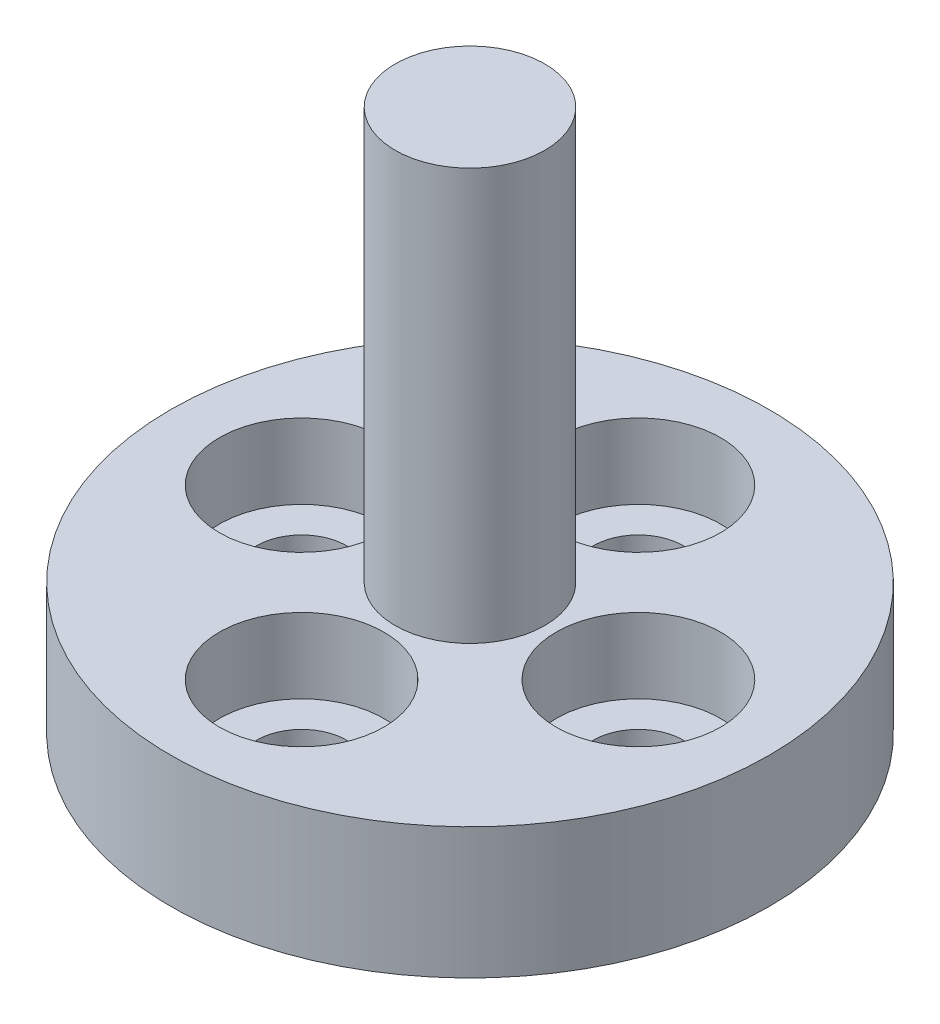
ISO-10303-21;
HEADER;
FILE_DESCRIPTION(('STEP AP214'),'2;1');
FILE_NAME('part.step','',(''),(''),'','','');
FILE_SCHEMA(('AUTOMOTIVE_DESIGN { 1 0 10303 214 1 1 1 1 }'));
ENDSEC;
DATA;
#1=APPLICATION_CONTEXT('core data for automotive mechanical design processes');
#2=APPLICATION_PROTOCOL_DEFINITION('international standard','automotive_design',2000,#1);
#3=PRODUCT_CONTEXT('',#1,'mechanical');
#4=PRODUCT('Part','Part','',(#3));
#5=PRODUCT_RELATED_PRODUCT_CATEGORY('part','',(#4));
#6=PRODUCT_DEFINITION_FORMATION('','',#4);
#7=PRODUCT_DEFINITION_CONTEXT('part definition',#1,'design');
#8=PRODUCT_DEFINITION('design','',#6,#7);
#9=PRODUCT_DEFINITION_SHAPE('','',#8);
#10=(LENGTH_UNIT() NAMED_UNIT(*) SI_UNIT(.MILLI.,.METRE.));
#11=(NAMED_UNIT(*) PLANE_ANGLE_UNIT() SI_UNIT($,.RADIAN.));
#12=(NAMED_UNIT(*) SI_UNIT($,.STERADIAN.) SOLID_ANGLE_UNIT());
#13=UNCERTAINTY_MEASURE_WITH_UNIT(LENGTH_MEASURE(1.E-05),#10,'distance_accuracy_value','');
#14=(GEOMETRIC_REPRESENTATION_CONTEXT(3) GLOBAL_UNCERTAINTY_ASSIGNED_CONTEXT((#13)) GLOBAL_UNIT_ASSIGNED_CONTEXT((#10,
#11,#12)) REPRESENTATION_CONTEXT('',''));
#15=CARTESIAN_POINT('',(0.,0.,0.));
#16=DIRECTION('',(0.,0.,1.));
#17=DIRECTION('',(1.,0.,0.));
#18=AXIS2_PLACEMENT_3D('',#15,#16,#17);
#19=CARTESIAN_POINT('',(8.,0.,0.));
#20=DIRECTION('',(0.,-1.,0.));
#21=DIRECTION('',(1.,0.,0.));
#22=AXIS2_PLACEMENT_3D('',#19,#20,#21);
#23=PLANE('',#22);
#24=CARTESIAN_POINT('',(-4.5,0.,0.));
#25=DIRECTION('',(0.,1.,0.));
#26=DIRECTION('',(0.,0.,1.));
#27=AXIS2_PLACEMENT_3D('',#24,#25,#26);
#28=CIRCLE('',#27,1.2);
#29=CARTESIAN_POINT('',(-4.5,0.,1.2));
#30=VERTEX_POINT('',#29);
#31=EDGE_CURVE('E114',#30,#30,#28,.T.);
#32=ORIENTED_EDGE('',*,*,#31,.T.);
#33=EDGE_LOOP('',(#32));
#34=FACE_BOUND('',#33,.T.);
#35=CARTESIAN_POINT('',(0.,0.,-4.5));
#36=DIRECTION('',(0.,1.,0.));
#37=DIRECTION('',(0.,0.,1.));
#38=AXIS2_PLACEMENT_3D('',#35,#36,#37);
#39=CIRCLE('',#38,1.2);
#40=CARTESIAN_POINT('',(0.,0.,-3.3));
#41=VERTEX_POINT('',#40);
#42=EDGE_CURVE('E98',#41,#41,#39,.T.);
#43=ORIENTED_EDGE('',*,*,#42,.T.);
#44=EDGE_LOOP('',(#43));
#45=FACE_BOUND('',#44,.T.);
#46=CARTESIAN_POINT('',(4.5,0.,0.));
#47=DIRECTION('',(0.,1.,0.));
#48=DIRECTION('',(0.,0.,1.));
#49=AXIS2_PLACEMENT_3D('',#46,#47,#48);
#50=CIRCLE('',#49,1.2);
#51=CARTESIAN_POINT('',(4.5,0.,1.2));
#52=VERTEX_POINT('',#51);
#53=EDGE_CURVE('E82',#52,#52,#50,.T.);
#54=ORIENTED_EDGE('',*,*,#53,.T.);
#55=EDGE_LOOP('',(#54));
#56=FACE_BOUND('',#55,.T.);
#57=CARTESIAN_POINT('',(0.,0.,4.5));
#58=DIRECTION('',(0.,1.,0.));
#59=DIRECTION('',(0.,0.,1.));
#60=AXIS2_PLACEMENT_3D('',#57,#58,#59);
#61=CIRCLE('',#60,1.2);
#62=CARTESIAN_POINT('',(0.,0.,5.7));
#63=VERTEX_POINT('',#62);
#64=EDGE_CURVE('E66',#63,#63,#61,.T.);
#65=ORIENTED_EDGE('',*,*,#64,.T.);
#66=EDGE_LOOP('',(#65));
#67=FACE_BOUND('',#66,.T.);
#68=CARTESIAN_POINT('',(0.,0.,0.));
#69=DIRECTION('',(0.,-1.,0.));
#70=DIRECTION('',(1.,0.,0.));
#71=AXIS2_PLACEMENT_3D('',#68,#69,#70);
#72=CIRCLE('',#71,8.);
#73=CARTESIAN_POINT('',(8.,0.,0.));
#74=VERTEX_POINT('',#73);
#75=EDGE_CURVE('E60',#74,#74,#72,.T.);
#76=ORIENTED_EDGE('',*,*,#75,.T.);
#77=EDGE_LOOP('',(#76));
#78=FACE_BOUND('',#77,.T.);
#79=ADVANCED_FACE('F43',(#34,#45,#56,#67,#78),#23,.T.);
#80=CARTESIAN_POINT('',(0.,14.5,0.));
#81=DIRECTION('',(0.,1.,0.));
#82=DIRECTION('',(-1.,0.,0.));
#83=AXIS2_PLACEMENT_3D('',#80,#81,#82);
#84=PLANE('',#83);
#85=CARTESIAN_POINT('',(0.,14.5,0.));
#86=DIRECTION('',(0.,-1.,0.));
#87=DIRECTION('',(1.,0.,0.));
#88=AXIS2_PLACEMENT_3D('',#85,#86,#87);
#89=CIRCLE('',#88,2.);
#90=CARTESIAN_POINT('',(2.,14.5,0.));
#91=VERTEX_POINT('',#90);
#92=EDGE_CURVE('E10',#91,#91,#89,.T.);
#93=ORIENTED_EDGE('',*,*,#92,.F.);
#94=EDGE_LOOP('',(#93));
#95=FACE_BOUND('',#94,.T.);
#96=ADVANCED_FACE('F154',(#95),#84,.T.);
#97=CARTESIAN_POINT('',(0.,0.,0.));
#98=DIRECTION('',(0.,-1.,0.));
#99=DIRECTION('',(1.,0.,0.));
#100=AXIS2_PLACEMENT_3D('',#97,#98,#99);
#101=CYLINDRICAL_SURFACE('',#100,2.);
#102=ORIENTED_EDGE('',*,*,#92,.T.);
#103=EDGE_LOOP('',(#102));
#104=FACE_BOUND('',#103,.T.);
#105=CARTESIAN_POINT('',(0.,3.5,0.));
#106=DIRECTION('',(0.,-1.,0.));
#107=DIRECTION('',(1.,0.,0.));
#108=AXIS2_PLACEMENT_3D('',#105,#106,#107);
#109=CIRCLE('',#108,2.);
#110=CARTESIAN_POINT('',(2.,3.5,0.));
#111=VERTEX_POINT('',#110);
#112=EDGE_CURVE('E50',#111,#111,#109,.T.);
#113=ORIENTED_EDGE('',*,*,#112,.F.);
#114=EDGE_LOOP('',(#113));
#115=FACE_BOUND('',#114,.T.);
#116=ADVANCED_FACE('F137',(#104,#115),#101,.T.);
#117=CARTESIAN_POINT('',(2.,3.5,0.));
#118=DIRECTION('',(0.,1.,0.));
#119=DIRECTION('',(-1.,0.,0.));
#120=AXIS2_PLACEMENT_3D('',#117,#118,#119);
#121=PLANE('',#120);
#122=CARTESIAN_POINT('',(-4.5,3.5,0.));
#123=DIRECTION('',(0.,1.,0.));
#124=DIRECTION('',(0.,0.,1.));
#125=AXIS2_PLACEMENT_3D('',#122,#123,#124);
#126=CIRCLE('',#125,2.19999999999999);
#127=CARTESIAN_POINT('',(-4.5,3.5,2.19999999999999));
#128=VERTEX_POINT('',#127);
#129=EDGE_CURVE('E126',#128,#128,#126,.T.);
#130=ORIENTED_EDGE('',*,*,#129,.F.);
#131=EDGE_LOOP('',(#130));
#132=FACE_BOUND('',#131,.T.);
#133=CARTESIAN_POINT('',(0.,3.5,-4.5));
#134=DIRECTION('',(0.,1.,0.));
#135=DIRECTION('',(0.,0.,1.));
#136=AXIS2_PLACEMENT_3D('',#133,#134,#135);
#137=CIRCLE('',#136,2.19999999999999);
#138=CARTESIAN_POINT('',(0.,3.5,-2.30000000000001));
#139=VERTEX_POINT('',#138);
#140=EDGE_CURVE('E110',#139,#139,#137,.T.);
#141=ORIENTED_EDGE('',*,*,#140,.F.);
#142=EDGE_LOOP('',(#141));
#143=FACE_BOUND('',#142,.T.);
#144=CARTESIAN_POINT('',(4.5,3.5,0.));
#145=DIRECTION('',(0.,1.,0.));
#146=DIRECTION('',(0.,0.,1.));
#147=AXIS2_PLACEMENT_3D('',#144,#145,#146);
#148=CIRCLE('',#147,2.19999999999999);
#149=CARTESIAN_POINT('',(4.5,3.5,2.19999999999999));
#150=VERTEX_POINT('',#149);
#151=EDGE_CURVE('E94',#150,#150,#148,.T.);
#152=ORIENTED_EDGE('',*,*,#151,.F.);
#153=EDGE_LOOP('',(#152));
#154=FACE_BOUND('',#153,.T.);
#155=CARTESIAN_POINT('',(0.,3.5,4.5));
#156=DIRECTION('',(0.,1.,0.));
#157=DIRECTION('',(0.,0.,1.));
#158=AXIS2_PLACEMENT_3D('',#155,#156,#157);
#159=CIRCLE('',#158,2.19999999999999);
#160=CARTESIAN_POINT('',(0.,3.5,6.69999999999999));
#161=VERTEX_POINT('',#160);
#162=EDGE_CURVE('E78',#161,#161,#159,.T.);
#163=ORIENTED_EDGE('',*,*,#162,.F.);
#164=EDGE_LOOP('',(#163));
#165=FACE_BOUND('',#164,.T.);
#166=ORIENTED_EDGE('',*,*,#112,.T.);
#167=EDGE_LOOP('',(#166));
#168=FACE_BOUND('',#167,.T.);
#169=CARTESIAN_POINT('',(0.,3.5,0.));
#170=DIRECTION('',(0.,-1.,0.));
#171=DIRECTION('',(1.,0.,0.));
#172=AXIS2_PLACEMENT_3D('',#169,#170,#171);
#173=CIRCLE('',#172,8.);
#174=CARTESIAN_POINT('',(8.,3.5,0.));
#175=VERTEX_POINT('',#174);
#176=EDGE_CURVE('E55',#175,#175,#173,.T.);
#177=ORIENTED_EDGE('',*,*,#176,.F.);
#178=EDGE_LOOP('',(#177));
#179=FACE_BOUND('',#178,.T.);
#180=ADVANCED_FACE('F133',(#132,#143,#154,#165,#168,#179),#121,.T.);
#181=CARTESIAN_POINT('',(0.,0.,0.));
#182=DIRECTION('',(0.,-1.,0.));
#183=DIRECTION('',(1.,0.,0.));
#184=AXIS2_PLACEMENT_3D('',#181,#182,#183);
#185=CYLINDRICAL_SURFACE('',#184,8.);
#186=ORIENTED_EDGE('',*,*,#176,.T.);
#187=EDGE_LOOP('',(#186));
#188=FACE_BOUND('',#187,.T.);
#189=ORIENTED_EDGE('',*,*,#75,.F.);
#190=EDGE_LOOP('',(#189));
#191=FACE_BOUND('',#190,.T.);
#192=ADVANCED_FACE('F136',(#188,#191),#185,.T.);
#193=CARTESIAN_POINT('',(0.,3.5,4.5));
#194=DIRECTION('',(0.,1.,0.));
#195=DIRECTION('',(0.,0.,1.));
#196=AXIS2_PLACEMENT_3D('',#193,#194,#195);
#197=CYLINDRICAL_SURFACE('',#196,1.2);
#198=ORIENTED_EDGE('',*,*,#64,.F.);
#199=EDGE_LOOP('',(#198));
#200=FACE_BOUND('',#199,.T.);
#201=CARTESIAN_POINT('',(0.,1.5,4.5));
#202=DIRECTION('',(0.,1.,0.));
#203=DIRECTION('',(0.,0.,1.));
#204=AXIS2_PLACEMENT_3D('',#201,#202,#203);
#205=CIRCLE('',#204,1.2);
#206=CARTESIAN_POINT('',(0.,1.5,5.7));
#207=VERTEX_POINT('',#206);
#208=EDGE_CURVE('E70',#207,#207,#205,.T.);
#209=ORIENTED_EDGE('',*,*,#208,.T.);
#210=EDGE_LOOP('',(#209));
#211=FACE_BOUND('',#210,.T.);
#212=ADVANCED_FACE('F149',(#200,#211),#197,.F.);
#213=CARTESIAN_POINT('',(1.2,1.5,4.5));
#214=DIRECTION('',(0.,-1.,0.));
#215=DIRECTION('',(0.,0.,-1.));
#216=AXIS2_PLACEMENT_3D('',#213,#214,#215);
#217=PLANE('',#216);
#218=ORIENTED_EDGE('',*,*,#208,.F.);
#219=EDGE_LOOP('',(#218));
#220=FACE_BOUND('',#219,.T.);
#221=CARTESIAN_POINT('',(0.,1.5,4.5));
#222=DIRECTION('',(0.,1.,0.));
#223=DIRECTION('',(0.,0.,1.));
#224=AXIS2_PLACEMENT_3D('',#221,#222,#223);
#225=CIRCLE('',#224,2.2);
#226=CARTESIAN_POINT('',(0.,1.5,6.7));
#227=VERTEX_POINT('',#226);
#228=EDGE_CURVE('E74',#227,#227,#225,.T.);
#229=ORIENTED_EDGE('',*,*,#228,.T.);
#230=EDGE_LOOP('',(#229));
#231=FACE_BOUND('',#230,.T.);
#232=ADVANCED_FACE('F170',(#220,#231),#217,.F.);
#233=CARTESIAN_POINT('',(0.,3.5,4.5));
#234=DIRECTION('',(0.,1.,0.));
#235=DIRECTION('',(0.,0.,1.));
#236=AXIS2_PLACEMENT_3D('',#233,#234,#235);
#237=CYLINDRICAL_SURFACE('',#236,2.19999999999999);
#238=ORIENTED_EDGE('',*,*,#228,.F.);
#239=EDGE_LOOP('',(#238));
#240=FACE_BOUND('',#239,.T.);
#241=ORIENTED_EDGE('',*,*,#162,.T.);
#242=EDGE_LOOP('',(#241));
#243=FACE_BOUND('',#242,.T.);
#244=ADVANCED_FACE('F176',(#240,#243),#237,.F.);
#245=CARTESIAN_POINT('',(4.5,3.5,0.));
#246=DIRECTION('',(0.,1.,0.));
#247=DIRECTION('',(0.,0.,1.));
#248=AXIS2_PLACEMENT_3D('',#245,#246,#247);
#249=CYLINDRICAL_SURFACE('',#248,1.2);
#250=ORIENTED_EDGE('',*,*,#53,.F.);
#251=EDGE_LOOP('',(#250));
#252=FACE_BOUND('',#251,.T.);
#253=CARTESIAN_POINT('',(4.5,1.5,0.));
#254=DIRECTION('',(0.,1.,0.));
#255=DIRECTION('',(0.,0.,1.));
#256=AXIS2_PLACEMENT_3D('',#253,#254,#255);
#257=CIRCLE('',#256,1.2);
#258=CARTESIAN_POINT('',(4.5,1.5,1.2));
#259=VERTEX_POINT('',#258);
#260=EDGE_CURVE('E86',#259,#259,#257,.T.);
#261=ORIENTED_EDGE('',*,*,#260,.T.);
#262=EDGE_LOOP('',(#261));
#263=FACE_BOUND('',#262,.T.);
#264=ADVANCED_FACE('F182',(#252,#263),#249,.F.);
#265=CARTESIAN_POINT('',(5.7,1.5,0.));
#266=DIRECTION('',(0.,-1.,0.));
#267=DIRECTION('',(0.,0.,-1.));
#268=AXIS2_PLACEMENT_3D('',#265,#266,#267);
#269=PLANE('',#268);
#270=ORIENTED_EDGE('',*,*,#260,.F.);
#271=EDGE_LOOP('',(#270));
#272=FACE_BOUND('',#271,.T.);
#273=CARTESIAN_POINT('',(4.5,1.5,0.));
#274=DIRECTION('',(0.,1.,0.));
#275=DIRECTION('',(0.,0.,1.));
#276=AXIS2_PLACEMENT_3D('',#273,#274,#275);
#277=CIRCLE('',#276,2.2);
#278=CARTESIAN_POINT('',(4.5,1.5,2.2));
#279=VERTEX_POINT('',#278);
#280=EDGE_CURVE('E90',#279,#279,#277,.T.);
#281=ORIENTED_EDGE('',*,*,#280,.T.);
#282=EDGE_LOOP('',(#281));
#283=FACE_BOUND('',#282,.T.);
#284=ADVANCED_FACE('F187',(#272,#283),#269,.F.);
#285=CARTESIAN_POINT('',(4.5,3.5,0.));
#286=DIRECTION('',(0.,1.,0.));
#287=DIRECTION('',(0.,0.,1.));
#288=AXIS2_PLACEMENT_3D('',#285,#286,#287);
#289=CYLINDRICAL_SURFACE('',#288,2.19999999999999);
#290=ORIENTED_EDGE('',*,*,#280,.F.);
#291=EDGE_LOOP('',(#290));
#292=FACE_BOUND('',#291,.T.);
#293=ORIENTED_EDGE('',*,*,#151,.T.);
#294=EDGE_LOOP('',(#293));
#295=FACE_BOUND('',#294,.T.);
#296=ADVANCED_FACE('F239',(#292,#295),#289,.F.);
#297=CARTESIAN_POINT('',(0.,3.5,-4.5));
#298=DIRECTION('',(0.,1.,0.));
#299=DIRECTION('',(0.,0.,1.));
#300=AXIS2_PLACEMENT_3D('',#297,#298,#299);
#301=CYLINDRICAL_SURFACE('',#300,1.2);
#302=ORIENTED_EDGE('',*,*,#42,.F.);
#303=EDGE_LOOP('',(#302));
#304=FACE_BOUND('',#303,.T.);
#305=CARTESIAN_POINT('',(0.,1.5,-4.5));
#306=DIRECTION('',(0.,1.,0.));
#307=DIRECTION('',(0.,0.,1.));
#308=AXIS2_PLACEMENT_3D('',#305,#306,#307);
#309=CIRCLE('',#308,1.2);
#310=CARTESIAN_POINT('',(0.,1.5,-3.3));
#311=VERTEX_POINT('',#310);
#312=EDGE_CURVE('E102',#311,#311,#309,.T.);
#313=ORIENTED_EDGE('',*,*,#312,.T.);
#314=EDGE_LOOP('',(#313));
#315=FACE_BOUND('',#314,.T.);
#316=ADVANCED_FACE('F248',(#304,#315),#301,.F.);
#317=CARTESIAN_POINT('',(1.2,1.5,-4.5));
#318=DIRECTION('',(0.,-1.,0.));
#319=DIRECTION('',(0.,0.,-1.));
#320=AXIS2_PLACEMENT_3D('',#317,#318,#319);
#321=PLANE('',#320);
#322=ORIENTED_EDGE('',*,*,#312,.F.);
#323=EDGE_LOOP('',(#322));
#324=FACE_BOUND('',#323,.T.);
#325=CARTESIAN_POINT('',(0.,1.5,-4.5));
#326=DIRECTION('',(0.,1.,0.));
#327=DIRECTION('',(0.,0.,1.));
#328=AXIS2_PLACEMENT_3D('',#325,#326,#327);
#329=CIRCLE('',#328,2.2);
#330=CARTESIAN_POINT('',(0.,1.5,-2.3));
#331=VERTEX_POINT('',#330);
#332=EDGE_CURVE('E106',#331,#331,#329,.T.);
#333=ORIENTED_EDGE('',*,*,#332,.T.);
#334=EDGE_LOOP('',(#333));
#335=FACE_BOUND('',#334,.T.);
#336=ADVANCED_FACE('F258',(#324,#335),#321,.F.);
#337=CARTESIAN_POINT('',(0.,3.5,-4.5));
#338=DIRECTION('',(0.,1.,0.));
#339=DIRECTION('',(0.,0.,1.));
#340=AXIS2_PLACEMENT_3D('',#337,#338,#339);
#341=CYLINDRICAL_SURFACE('',#340,2.19999999999999);
#342=ORIENTED_EDGE('',*,*,#332,.F.);
#343=EDGE_LOOP('',(#342));
#344=FACE_BOUND('',#343,.T.);
#345=ORIENTED_EDGE('',*,*,#140,.T.);
#346=EDGE_LOOP('',(#345));
#347=FACE_BOUND('',#346,.T.);
#348=ADVANCED_FACE('F268',(#344,#347),#341,.F.);
#349=CARTESIAN_POINT('',(-4.5,3.5,0.));
#350=DIRECTION('',(0.,1.,0.));
#351=DIRECTION('',(0.,0.,1.));
#352=AXIS2_PLACEMENT_3D('',#349,#350,#351);
#353=CYLINDRICAL_SURFACE('',#352,1.2);
#354=ORIENTED_EDGE('',*,*,#31,.F.);
#355=EDGE_LOOP('',(#354));
#356=FACE_BOUND('',#355,.T.);
#357=CARTESIAN_POINT('',(-4.5,1.5,0.));
#358=DIRECTION('',(0.,1.,0.));
#359=DIRECTION('',(0.,0.,1.));
#360=AXIS2_PLACEMENT_3D('',#357,#358,#359);
#361=CIRCLE('',#360,1.2);
#362=CARTESIAN_POINT('',(-4.5,1.5,1.2));
#363=VERTEX_POINT('',#362);
#364=EDGE_CURVE('E118',#363,#363,#361,.T.);
#365=ORIENTED_EDGE('',*,*,#364,.T.);
#366=EDGE_LOOP('',(#365));
#367=FACE_BOUND('',#366,.T.);
#368=ADVANCED_FACE('F278',(#356,#367),#353,.F.);
#369=CARTESIAN_POINT('',(-3.3,1.5,0.));
#370=DIRECTION('',(0.,-1.,0.));
#371=DIRECTION('',(0.,0.,-1.));
#372=AXIS2_PLACEMENT_3D('',#369,#370,#371);
#373=PLANE('',#372);
#374=ORIENTED_EDGE('',*,*,#364,.F.);
#375=EDGE_LOOP('',(#374));
#376=FACE_BOUND('',#375,.T.);
#377=CARTESIAN_POINT('',(-4.5,1.5,0.));
#378=DIRECTION('',(0.,1.,0.));
#379=DIRECTION('',(0.,0.,1.));
#380=AXIS2_PLACEMENT_3D('',#377,#378,#379);
#381=CIRCLE('',#380,2.2);
#382=CARTESIAN_POINT('',(-4.5,1.5,2.2));
#383=VERTEX_POINT('',#382);
#384=EDGE_CURVE('E122',#383,#383,#381,.T.);
#385=ORIENTED_EDGE('',*,*,#384,.T.);
#386=EDGE_LOOP('',(#385));
#387=FACE_BOUND('',#386,.T.);
#388=ADVANCED_FACE('F288',(#376,#387),#373,.F.);
#389=CARTESIAN_POINT('',(-4.5,3.5,0.));
#390=DIRECTION('',(0.,1.,0.));
#391=DIRECTION('',(0.,0.,1.));
#392=AXIS2_PLACEMENT_3D('',#389,#390,#391);
#393=CYLINDRICAL_SURFACE('',#392,2.19999999999999);
#394=ORIENTED_EDGE('',*,*,#384,.F.);
#395=EDGE_LOOP('',(#394));
#396=FACE_BOUND('',#395,.T.);
#397=ORIENTED_EDGE('',*,*,#129,.T.);
#398=EDGE_LOOP('',(#397));
#399=FACE_BOUND('',#398,.T.);
#400=ADVANCED_FACE('F131',(#396,#399),#393,.F.);
#401=CLOSED_SHELL('',(#79,#96,#116,#180,#192,#212,#232,#244,#264,#284,#296,#316,#336,#348,#368,
#388,#400));
#402=MANIFOLD_SOLID_BREP('B2',#401);
#403=ADVANCED_BREP_SHAPE_REPRESENTATION('',(#18,#402),#14);
#404=SHAPE_DEFINITION_REPRESENTATION(#9,#403);
ENDSEC;
END-ISO-10303-21;
